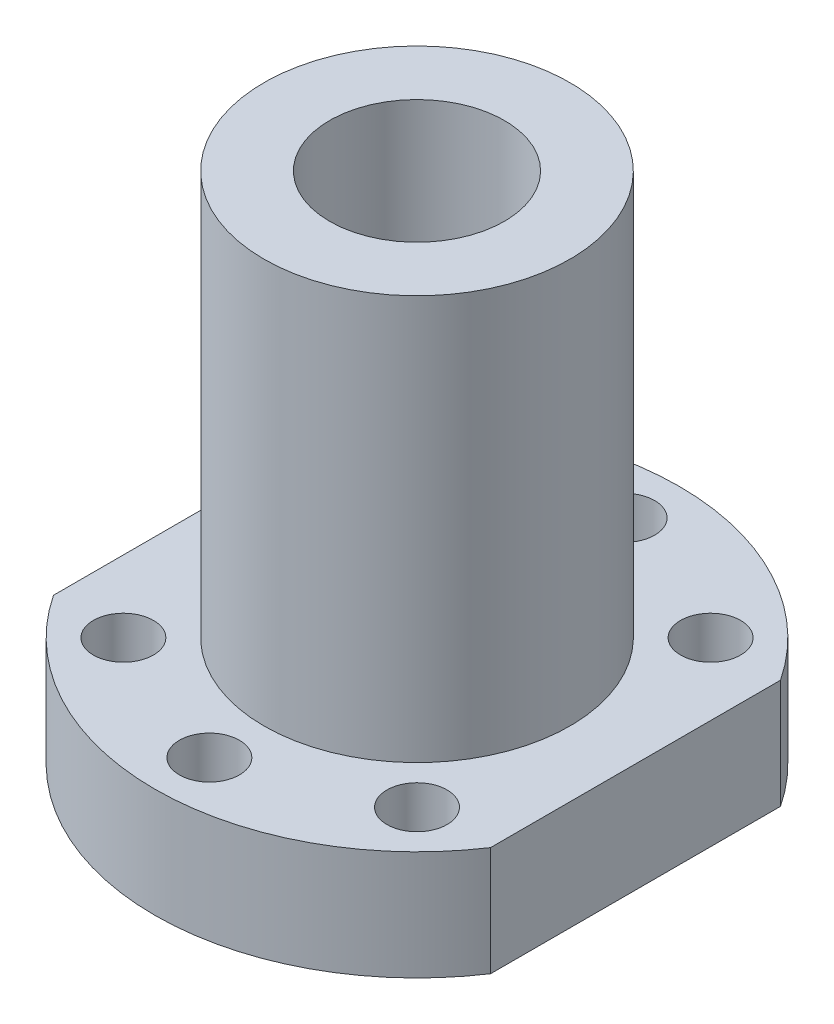
ISO-10303-21;
HEADER;
FILE_DESCRIPTION(('STEP AP214'),'2;1');
FILE_NAME('part.step','',(''),(''),'','','');
FILE_SCHEMA(('AUTOMOTIVE_DESIGN { 1 0 10303 214 1 1 1 1 }'));
ENDSEC;
DATA;
#1=APPLICATION_CONTEXT('core data for automotive mechanical design processes');
#2=APPLICATION_PROTOCOL_DEFINITION('international standard','automotive_design',2000,#1);
#3=PRODUCT_CONTEXT('',#1,'mechanical');
#4=PRODUCT('Part','Part','',(#3));
#5=PRODUCT_RELATED_PRODUCT_CATEGORY('part','',(#4));
#6=PRODUCT_DEFINITION_FORMATION('','',#4);
#7=PRODUCT_DEFINITION_CONTEXT('part definition',#1,'design');
#8=PRODUCT_DEFINITION('design','',#6,#7);
#9=PRODUCT_DEFINITION_SHAPE('','',#8);
#10=(LENGTH_UNIT() NAMED_UNIT(*) SI_UNIT(.MILLI.,.METRE.));
#11=(NAMED_UNIT(*) PLANE_ANGLE_UNIT() SI_UNIT($,.RADIAN.));
#12=(NAMED_UNIT(*) SI_UNIT($,.STERADIAN.) SOLID_ANGLE_UNIT());
#13=UNCERTAINTY_MEASURE_WITH_UNIT(LENGTH_MEASURE(1.E-05),#10,'distance_accuracy_value','');
#14=(GEOMETRIC_REPRESENTATION_CONTEXT(3) GLOBAL_UNCERTAINTY_ASSIGNED_CONTEXT((#13)) GLOBAL_UNIT_ASSIGNED_CONTEXT((#10,
#11,#12)) REPRESENTATION_CONTEXT('',''));
#15=CARTESIAN_POINT('',(0.,0.,0.));
#16=DIRECTION('',(0.,0.,1.));
#17=DIRECTION('',(1.,0.,0.));
#18=AXIS2_PLACEMENT_3D('',#15,#16,#17);
#19=CARTESIAN_POINT('',(20.,10.,0.));
#20=DIRECTION('',(1.,0.,0.));
#21=DIRECTION('',(0.,0.,-1.));
#22=AXIS2_PLACEMENT_3D('',#19,#20,#21);
#23=PLANE('',#22);
#24=DIRECTION('',(0.,0.,1.));
#25=VECTOR('',#24,1.);
#26=CARTESIAN_POINT('',(20.,0.,0.));
#27=LINE('',#26,#25);
#28=CARTESIAN_POINT('',(20.,0.,-13.2664991614216));
#29=VERTEX_POINT('',#28);
#30=CARTESIAN_POINT('',(20.,0.,13.2664991614216));
#31=VERTEX_POINT('',#30);
#32=EDGE_CURVE('E146',#29,#31,#27,.T.);
#33=ORIENTED_EDGE('',*,*,#32,.F.);
#34=DIRECTION('',(0.,-1.,0.));
#35=VECTOR('',#34,1.);
#36=CARTESIAN_POINT('',(20.,10.,-13.2664991614216));
#37=LINE('',#36,#35);
#38=CARTESIAN_POINT('',(20.,10.,-13.2664991614216));
#39=VERTEX_POINT('',#38);
#40=EDGE_CURVE('E11',#39,#29,#37,.T.);
#41=ORIENTED_EDGE('',*,*,#40,.F.);
#42=DIRECTION('',(0.,0.,1.));
#43=VECTOR('',#42,1.);
#44=CARTESIAN_POINT('',(20.,10.,0.));
#45=LINE('',#44,#43);
#46=CARTESIAN_POINT('',(20.,10.,13.2664991614216));
#47=VERTEX_POINT('',#46);
#48=EDGE_CURVE('E106',#39,#47,#45,.T.);
#49=ORIENTED_EDGE('',*,*,#48,.T.);
#50=DIRECTION('',(0.,-1.,0.));
#51=VECTOR('',#50,1.);
#52=CARTESIAN_POINT('',(20.,10.,13.2664991614216));
#53=LINE('',#52,#51);
#54=EDGE_CURVE('E86',#47,#31,#53,.T.);
#55=ORIENTED_EDGE('',*,*,#54,.T.);
#56=EDGE_LOOP('',(#33,#41,#49,#55));
#57=FACE_BOUND('',#56,.T.);
#58=ADVANCED_FACE('F40',(#57),#23,.T.);
#59=CARTESIAN_POINT('',(0.,10.,0.));
#60=DIRECTION('',(0.,-1.,0.));
#61=DIRECTION('',(0.,0.,-1.));
#62=AXIS2_PLACEMENT_3D('',#59,#60,#61);
#63=CYLINDRICAL_SURFACE('',#62,24.);
#64=CARTESIAN_POINT('',(0.,0.,0.));
#65=DIRECTION('',(0.,1.,0.));
#66=DIRECTION('',(0.,0.,1.));
#67=AXIS2_PLACEMENT_3D('',#64,#65,#66);
#68=CIRCLE('',#67,24.);
#69=CARTESIAN_POINT('',(-20.,0.,-13.2664991614216));
#70=VERTEX_POINT('',#69);
#71=EDGE_CURVE('E112',#29,#70,#68,.T.);
#72=ORIENTED_EDGE('',*,*,#71,.T.);
#73=DIRECTION('',(0.,-1.,0.));
#74=VECTOR('',#73,1.);
#75=CARTESIAN_POINT('',(-20.,10.,-13.2664991614216));
#76=LINE('',#75,#74);
#77=CARTESIAN_POINT('',(-20.,10.,-13.2664991614216));
#78=VERTEX_POINT('',#77);
#79=EDGE_CURVE('E56',#78,#70,#76,.T.);
#80=ORIENTED_EDGE('',*,*,#79,.F.);
#81=CARTESIAN_POINT('',(0.,10.,0.));
#82=DIRECTION('',(0.,1.,0.));
#83=DIRECTION('',(0.,0.,1.));
#84=AXIS2_PLACEMENT_3D('',#81,#82,#83);
#85=CIRCLE('',#84,24.);
#86=EDGE_CURVE('E102',#39,#78,#85,.T.);
#87=ORIENTED_EDGE('',*,*,#86,.F.);
#88=ORIENTED_EDGE('',*,*,#40,.T.);
#89=EDGE_LOOP('',(#72,#80,#87,#88));
#90=FACE_BOUND('',#89,.T.);
#91=ADVANCED_FACE('F110',(#90),#63,.T.);
#92=CARTESIAN_POINT('',(-20.,10.,0.));
#93=DIRECTION('',(1.,0.,0.));
#94=DIRECTION('',(0.,0.,-1.));
#95=AXIS2_PLACEMENT_3D('',#92,#93,#94);
#96=PLANE('',#95);
#97=CARTESIAN_POINT('',(-20.,5.,0.));
#98=DIRECTION('',(-1.,0.,0.));
#99=DIRECTION('',(0.,0.,1.));
#100=AXIS2_PLACEMENT_3D('',#97,#98,#99);
#101=CIRCLE('',#100,3.);
#102=CARTESIAN_POINT('',(-20.,5.,3.));
#103=VERTEX_POINT('',#102);
#104=EDGE_CURVE('E199',#103,#103,#101,.T.);
#105=ORIENTED_EDGE('',*,*,#104,.F.);
#106=EDGE_LOOP('',(#105));
#107=FACE_BOUND('',#106,.T.);
#108=DIRECTION('',(0.,0.,1.));
#109=VECTOR('',#108,1.);
#110=CARTESIAN_POINT('',(-20.,0.,0.));
#111=LINE('',#110,#109);
#112=CARTESIAN_POINT('',(-20.,0.,13.2664991614216));
#113=VERTEX_POINT('',#112);
#114=EDGE_CURVE('E141',#70,#113,#111,.T.);
#115=ORIENTED_EDGE('',*,*,#114,.T.);
#116=DIRECTION('',(0.,-1.,0.));
#117=VECTOR('',#116,1.);
#118=CARTESIAN_POINT('',(-20.,10.,13.2664991614216));
#119=LINE('',#118,#117);
#120=CARTESIAN_POINT('',(-20.,10.,13.2664991614216));
#121=VERTEX_POINT('',#120);
#122=EDGE_CURVE('E100',#121,#113,#119,.T.);
#123=ORIENTED_EDGE('',*,*,#122,.F.);
#124=DIRECTION('',(0.,0.,1.));
#125=VECTOR('',#124,1.);
#126=CARTESIAN_POINT('',(-20.,10.,0.));
#127=LINE('',#126,#125);
#128=EDGE_CURVE('E94',#78,#121,#127,.T.);
#129=ORIENTED_EDGE('',*,*,#128,.F.);
#130=ORIENTED_EDGE('',*,*,#79,.T.);
#131=EDGE_LOOP('',(#115,#123,#129,#130));
#132=FACE_BOUND('',#131,.T.);
#133=ADVANCED_FACE('F97',(#107,#132),#96,.F.);
#134=CARTESIAN_POINT('',(13.4350288425444,10.,13.4350288425444));
#135=DIRECTION('',(0.,-1.,0.));
#136=DIRECTION('',(0.,0.,-1.));
#137=AXIS2_PLACEMENT_3D('',#134,#135,#136);
#138=CYLINDRICAL_SURFACE('',#137,2.75);
#139=CARTESIAN_POINT('',(13.4350288425444,10.,13.4350288425444));
#140=DIRECTION('',(0.,1.,0.));
#141=DIRECTION('',(0.,0.,1.));
#142=AXIS2_PLACEMENT_3D('',#139,#140,#141);
#143=CIRCLE('',#142,2.75);
#144=CARTESIAN_POINT('',(13.4350288425444,10.,16.1850288425444));
#145=VERTEX_POINT('',#144);
#146=EDGE_CURVE('E161',#145,#145,#143,.F.);
#147=ORIENTED_EDGE('',*,*,#146,.F.);
#148=EDGE_LOOP('',(#147));
#149=FACE_BOUND('',#148,.T.);
#150=CARTESIAN_POINT('',(13.4350288425444,0.,13.4350288425444));
#151=DIRECTION('',(0.,1.,0.));
#152=DIRECTION('',(0.,0.,1.));
#153=AXIS2_PLACEMENT_3D('',#150,#151,#152);
#154=CIRCLE('',#153,2.75);
#155=CARTESIAN_POINT('',(13.4350288425444,0.,16.1850288425444));
#156=VERTEX_POINT('',#155);
#157=EDGE_CURVE('E127',#156,#156,#154,.F.);
#158=ORIENTED_EDGE('',*,*,#157,.T.);
#159=EDGE_LOOP('',(#158));
#160=FACE_BOUND('',#159,.T.);
#161=ADVANCED_FACE('F270',(#149,#160),#138,.F.);
#162=CARTESIAN_POINT('',(-13.4350288425444,10.,13.4350288425444));
#163=DIRECTION('',(0.,-1.,0.));
#164=DIRECTION('',(0.,0.,-1.));
#165=AXIS2_PLACEMENT_3D('',#162,#163,#164);
#166=CYLINDRICAL_SURFACE('',#165,2.75);
#167=CARTESIAN_POINT('',(-13.4350288425444,10.,13.4350288425444));
#168=DIRECTION('',(0.,1.,0.));
#169=DIRECTION('',(0.,0.,1.));
#170=AXIS2_PLACEMENT_3D('',#167,#168,#169);
#171=CIRCLE('',#170,2.75);
#172=CARTESIAN_POINT('',(-13.4350288425444,10.,16.1850288425444));
#173=VERTEX_POINT('',#172);
#174=EDGE_CURVE('E165',#173,#173,#171,.T.);
#175=ORIENTED_EDGE('',*,*,#174,.T.);
#176=EDGE_LOOP('',(#175));
#177=FACE_BOUND('',#176,.T.);
#178=CARTESIAN_POINT('',(-13.4350288425444,0.,13.4350288425444));
#179=DIRECTION('',(0.,1.,0.));
#180=DIRECTION('',(0.,0.,1.));
#181=AXIS2_PLACEMENT_3D('',#178,#179,#180);
#182=CIRCLE('',#181,2.75);
#183=CARTESIAN_POINT('',(-13.4350288425444,0.,16.1850288425444));
#184=VERTEX_POINT('',#183);
#185=EDGE_CURVE('E131',#184,#184,#182,.T.);
#186=ORIENTED_EDGE('',*,*,#185,.F.);
#187=EDGE_LOOP('',(#186));
#188=FACE_BOUND('',#187,.T.);
#189=ADVANCED_FACE('F273',(#177,#188),#166,.F.);
#190=CARTESIAN_POINT('',(0.,10.,19.));
#191=DIRECTION('',(0.,-1.,0.));
#192=DIRECTION('',(0.,0.,-1.));
#193=AXIS2_PLACEMENT_3D('',#190,#191,#192);
#194=CYLINDRICAL_SURFACE('',#193,2.75);
#195=CARTESIAN_POINT('',(0.,10.,19.));
#196=DIRECTION('',(0.,1.,0.));
#197=DIRECTION('',(0.,0.,1.));
#198=AXIS2_PLACEMENT_3D('',#195,#196,#197);
#199=CIRCLE('',#198,2.75);
#200=CARTESIAN_POINT('',(0.,10.,21.75));
#201=VERTEX_POINT('',#200);
#202=EDGE_CURVE('E169',#201,#201,#199,.T.);
#203=ORIENTED_EDGE('',*,*,#202,.T.);
#204=EDGE_LOOP('',(#203));
#205=FACE_BOUND('',#204,.T.);
#206=CARTESIAN_POINT('',(0.,0.,19.));
#207=DIRECTION('',(0.,1.,0.));
#208=DIRECTION('',(0.,0.,1.));
#209=AXIS2_PLACEMENT_3D('',#206,#207,#208);
#210=CIRCLE('',#209,2.75);
#211=CARTESIAN_POINT('',(0.,0.,21.75));
#212=VERTEX_POINT('',#211);
#213=EDGE_CURVE('E135',#212,#212,#210,.T.);
#214=ORIENTED_EDGE('',*,*,#213,.F.);
#215=EDGE_LOOP('',(#214));
#216=FACE_BOUND('',#215,.T.);
#217=ADVANCED_FACE('F249',(#205,#216),#194,.F.);
#218=CARTESIAN_POINT('',(0.,10.,0.));
#219=DIRECTION('',(0.,-1.,0.));
#220=DIRECTION('',(0.,0.,-1.));
#221=AXIS2_PLACEMENT_3D('',#218,#219,#220);
#222=CYLINDRICAL_SURFACE('',#221,24.);
#223=CARTESIAN_POINT('',(0.,0.,0.));
#224=DIRECTION('',(0.,1.,0.));
#225=DIRECTION('',(0.,0.,1.));
#226=AXIS2_PLACEMENT_3D('',#223,#224,#225);
#227=CIRCLE('',#226,24.);
#228=EDGE_CURVE('E79',#113,#31,#227,.T.);
#229=ORIENTED_EDGE('',*,*,#228,.T.);
#230=ORIENTED_EDGE('',*,*,#54,.F.);
#231=CARTESIAN_POINT('',(0.,10.,0.));
#232=DIRECTION('',(0.,1.,0.));
#233=DIRECTION('',(0.,0.,1.));
#234=AXIS2_PLACEMENT_3D('',#231,#232,#233);
#235=CIRCLE('',#234,24.);
#236=EDGE_CURVE('E64',#121,#47,#235,.T.);
#237=ORIENTED_EDGE('',*,*,#236,.F.);
#238=ORIENTED_EDGE('',*,*,#122,.T.);
#239=EDGE_LOOP('',(#229,#230,#237,#238));
#240=FACE_BOUND('',#239,.T.);
#241=ADVANCED_FACE('F242',(#240),#222,.T.);
#242=CARTESIAN_POINT('',(13.4350288425444,10.,-13.4350288425444));
#243=DIRECTION('',(0.,-1.,0.));
#244=DIRECTION('',(0.,0.,-1.));
#245=AXIS2_PLACEMENT_3D('',#242,#243,#244);
#246=CYLINDRICAL_SURFACE('',#245,2.75);
#247=CARTESIAN_POINT('',(13.4350288425444,10.,-13.4350288425444));
#248=DIRECTION('',(0.,1.,0.));
#249=DIRECTION('',(0.,0.,1.));
#250=AXIS2_PLACEMENT_3D('',#247,#248,#249);
#251=CIRCLE('',#250,2.75);
#252=CARTESIAN_POINT('',(13.4350288425444,10.,-10.6850288425444));
#253=VERTEX_POINT('',#252);
#254=EDGE_CURVE('E181',#253,#253,#251,.T.);
#255=ORIENTED_EDGE('',*,*,#254,.T.);
#256=EDGE_LOOP('',(#255));
#257=FACE_BOUND('',#256,.T.);
#258=CARTESIAN_POINT('',(13.4350288425444,0.,-13.4350288425444));
#259=DIRECTION('',(0.,1.,0.));
#260=DIRECTION('',(0.,0.,1.));
#261=AXIS2_PLACEMENT_3D('',#258,#259,#260);
#262=CIRCLE('',#261,2.75);
#263=CARTESIAN_POINT('',(13.4350288425444,0.,-10.6850288425444));
#264=VERTEX_POINT('',#263);
#265=EDGE_CURVE('E149',#264,#264,#262,.T.);
#266=ORIENTED_EDGE('',*,*,#265,.F.);
#267=EDGE_LOOP('',(#266));
#268=FACE_BOUND('',#267,.T.);
#269=ADVANCED_FACE('F240',(#257,#268),#246,.F.);
#270=CARTESIAN_POINT('',(0.,10.,-19.));
#271=DIRECTION('',(0.,-1.,0.));
#272=DIRECTION('',(0.,0.,-1.));
#273=AXIS2_PLACEMENT_3D('',#270,#271,#272);
#274=CYLINDRICAL_SURFACE('',#273,2.75);
#275=CARTESIAN_POINT('',(0.,10.,-19.));
#276=DIRECTION('',(0.,1.,0.));
#277=DIRECTION('',(0.,0.,1.));
#278=AXIS2_PLACEMENT_3D('',#275,#276,#277);
#279=CIRCLE('',#278,2.75);
#280=CARTESIAN_POINT('',(0.,10.,-16.25));
#281=VERTEX_POINT('',#280);
#282=EDGE_CURVE('E126',#281,#281,#279,.F.);
#283=ORIENTED_EDGE('',*,*,#282,.F.);
#284=EDGE_LOOP('',(#283));
#285=FACE_BOUND('',#284,.T.);
#286=CARTESIAN_POINT('',(0.,0.,-19.));
#287=DIRECTION('',(0.,1.,0.));
#288=DIRECTION('',(0.,0.,1.));
#289=AXIS2_PLACEMENT_3D('',#286,#287,#288);
#290=CIRCLE('',#289,2.75);
#291=CARTESIAN_POINT('',(0.,0.,-16.25));
#292=VERTEX_POINT('',#291);
#293=EDGE_CURVE('E153',#292,#292,#290,.F.);
#294=ORIENTED_EDGE('',*,*,#293,.T.);
#295=EDGE_LOOP('',(#294));
#296=FACE_BOUND('',#295,.T.);
#297=ADVANCED_FACE('F42',(#285,#296),#274,.F.);
#298=CARTESIAN_POINT('',(-13.4350288425444,10.,-13.4350288425444));
#299=DIRECTION('',(0.,-1.,0.));
#300=DIRECTION('',(0.,0.,-1.));
#301=AXIS2_PLACEMENT_3D('',#298,#299,#300);
#302=CYLINDRICAL_SURFACE('',#301,2.75);
#303=CARTESIAN_POINT('',(-13.4350288425444,10.,-13.4350288425444));
#304=DIRECTION('',(0.,1.,0.));
#305=DIRECTION('',(0.,0.,1.));
#306=AXIS2_PLACEMENT_3D('',#303,#304,#305);
#307=CIRCLE('',#306,2.75);
#308=CARTESIAN_POINT('',(-13.4350288425444,10.,-10.6850288425444));
#309=VERTEX_POINT('',#308);
#310=EDGE_CURVE('E121',#309,#309,#307,.F.);
#311=ORIENTED_EDGE('',*,*,#310,.F.);
#312=EDGE_LOOP('',(#311));
#313=FACE_BOUND('',#312,.T.);
#314=CARTESIAN_POINT('',(-13.4350288425444,0.,-13.4350288425444));
#315=DIRECTION('',(0.,1.,0.));
#316=DIRECTION('',(0.,0.,1.));
#317=AXIS2_PLACEMENT_3D('',#314,#315,#316);
#318=CIRCLE('',#317,2.75);
#319=CARTESIAN_POINT('',(-13.4350288425444,0.,-10.6850288425444));
#320=VERTEX_POINT('',#319);
#321=EDGE_CURVE('E122',#320,#320,#318,.F.);
#322=ORIENTED_EDGE('',*,*,#321,.T.);
#323=EDGE_LOOP('',(#322));
#324=FACE_BOUND('',#323,.T.);
#325=ADVANCED_FACE('F227',(#313,#324),#302,.F.);
#326=CARTESIAN_POINT('',(0.,10.,0.));
#327=DIRECTION('',(0.,1.,0.));
#328=DIRECTION('',(0.,0.,1.));
#329=AXIS2_PLACEMENT_3D('',#326,#327,#328);
#330=PLANE('',#329);
#331=ORIENTED_EDGE('',*,*,#282,.T.);
#332=EDGE_LOOP('',(#331));
#333=FACE_BOUND('',#332,.T.);
#334=ORIENTED_EDGE('',*,*,#254,.F.);
#335=EDGE_LOOP('',(#334));
#336=FACE_BOUND('',#335,.T.);
#337=ORIENTED_EDGE('',*,*,#48,.F.);
#338=ORIENTED_EDGE('',*,*,#86,.T.);
#339=ORIENTED_EDGE('',*,*,#128,.T.);
#340=ORIENTED_EDGE('',*,*,#236,.T.);
#341=EDGE_LOOP('',(#337,#338,#339,#340));
#342=FACE_BOUND('',#341,.T.);
#343=CARTESIAN_POINT('',(0.,10.,0.));
#344=DIRECTION('',(0.,1.,0.));
#345=DIRECTION('',(0.,0.,1.));
#346=AXIS2_PLACEMENT_3D('',#343,#344,#345);
#347=CIRCLE('',#346,14.);
#348=CARTESIAN_POINT('',(0.,10.,14.));
#349=VERTEX_POINT('',#348);
#350=EDGE_CURVE('E173',#349,#349,#347,.T.);
#351=ORIENTED_EDGE('',*,*,#350,.F.);
#352=EDGE_LOOP('',(#351));
#353=FACE_BOUND('',#352,.T.);
#354=ORIENTED_EDGE('',*,*,#202,.F.);
#355=EDGE_LOOP('',(#354));
#356=FACE_BOUND('',#355,.T.);
#357=ORIENTED_EDGE('',*,*,#174,.F.);
#358=EDGE_LOOP('',(#357));
#359=FACE_BOUND('',#358,.T.);
#360=ORIENTED_EDGE('',*,*,#146,.T.);
#361=EDGE_LOOP('',(#360));
#362=FACE_BOUND('',#361,.T.);
#363=ORIENTED_EDGE('',*,*,#310,.T.);
#364=EDGE_LOOP('',(#363));
#365=FACE_BOUND('',#364,.T.);
#366=ADVANCED_FACE('F104',(#333,#336,#342,#353,#356,#359,#362,#365),#330,.T.);
#367=CARTESIAN_POINT('',(0.,0.,0.));
#368=DIRECTION('',(0.,1.,0.));
#369=DIRECTION('',(0.,0.,1.));
#370=AXIS2_PLACEMENT_3D('',#367,#368,#369);
#371=PLANE('',#370);
#372=ORIENTED_EDGE('',*,*,#293,.F.);
#373=EDGE_LOOP('',(#372));
#374=FACE_BOUND('',#373,.T.);
#375=ORIENTED_EDGE('',*,*,#265,.T.);
#376=EDGE_LOOP('',(#375));
#377=FACE_BOUND('',#376,.T.);
#378=ORIENTED_EDGE('',*,*,#32,.T.);
#379=ORIENTED_EDGE('',*,*,#228,.F.);
#380=ORIENTED_EDGE('',*,*,#114,.F.);
#381=ORIENTED_EDGE('',*,*,#71,.F.);
#382=EDGE_LOOP('',(#378,#379,#380,#381));
#383=FACE_BOUND('',#382,.T.);
#384=ORIENTED_EDGE('',*,*,#213,.T.);
#385=EDGE_LOOP('',(#384));
#386=FACE_BOUND('',#385,.T.);
#387=ORIENTED_EDGE('',*,*,#185,.T.);
#388=EDGE_LOOP('',(#387));
#389=FACE_BOUND('',#388,.T.);
#390=ORIENTED_EDGE('',*,*,#157,.F.);
#391=EDGE_LOOP('',(#390));
#392=FACE_BOUND('',#391,.T.);
#393=ORIENTED_EDGE('',*,*,#321,.F.);
#394=EDGE_LOOP('',(#393));
#395=FACE_BOUND('',#394,.T.);
#396=CARTESIAN_POINT('',(0.,0.,0.));
#397=DIRECTION('',(0.,1.,0.));
#398=DIRECTION('',(0.,0.,1.));
#399=AXIS2_PLACEMENT_3D('',#396,#397,#398);
#400=CIRCLE('',#399,8.);
#401=CARTESIAN_POINT('',(0.,0.,8.));
#402=VERTEX_POINT('',#401);
#403=EDGE_CURVE('E188',#402,#402,#400,.T.);
#404=ORIENTED_EDGE('',*,*,#403,.T.);
#405=EDGE_LOOP('',(#404));
#406=FACE_BOUND('',#405,.T.);
#407=ADVANCED_FACE('F216',(#374,#377,#383,#386,#389,#392,#395,#406),#371,.F.);
#408=CARTESIAN_POINT('',(0.,47.,0.));
#409=DIRECTION('',(0.,-1.,0.));
#410=DIRECTION('',(0.,0.,-1.));
#411=AXIS2_PLACEMENT_3D('',#408,#409,#410);
#412=CYLINDRICAL_SURFACE('',#411,8.);
#413=CARTESIAN_POINT('',(-7.41619848709566,5.,3.));
#414=CARTESIAN_POINT('',(-7.41619281215226,4.8379850325166,3.00000608211288));
#415=CARTESIAN_POINT('',(-7.42156520296313,4.67601015487381,2.98683195095364));
#416=CARTESIAN_POINT('',(-7.44232318425766,4.35694383406478,2.93472375787483));
#417=CARTESIAN_POINT('',(-7.45770847484803,4.19985224478832,2.89579046745932));
#418=CARTESIAN_POINT('',(-7.49650960610891,3.89524925681117,2.79379315222297));
#419=CARTESIAN_POINT('',(-7.51990619151696,3.74771588670809,2.73078694533005));
#420=CARTESIAN_POINT('',(-7.57206268400018,3.46525620635206,2.58263713485087));
#421=CARTESIAN_POINT('',(-7.60082420131042,3.33033369943215,2.49748688189993));
#422=CARTESIAN_POINT('',(-7.66207149335192,3.0702193767573,2.30293322748412));
#423=CARTESIAN_POINT('',(-7.69466683848217,2.945742940742,2.19260762426636));
#424=CARTESIAN_POINT('',(-7.75899501256083,2.71655437065623,1.95279167955762));
#425=CARTESIAN_POINT('',(-7.79072765629295,2.61184645251608,1.8232972605133));
#426=CARTESIAN_POINT('',(-7.8510574787339,2.421720975409,1.54338931035527));
#427=CARTESIAN_POINT('',(-7.87951122447087,2.33708105056834,1.39241389507607));
#428=CARTESIAN_POINT('',(-7.92876015947619,2.19469765495012,1.07711154393048));
#429=CARTESIAN_POINT('',(-7.94955800433994,2.13694485601604,0.912789261867066));
#430=CARTESIAN_POINT('',(-7.98037394206897,2.05248420845078,0.582978683353669));
#431=CARTESIAN_POINT('',(-7.99081830429549,2.02454474511909,0.417846394563197));
#432=CARTESIAN_POINT('',(-8.0012802821588,1.99655759811003,0.0849287275895673));
#433=CARTESIAN_POINT('',(-8.0013012882982,1.9965008447626,-0.0828557701256795));
#434=CARTESIAN_POINT('',(-7.99118531807773,2.02356352293033,-0.407487086128939));
#435=CARTESIAN_POINT('',(-7.98155083993306,2.04933859589756,-0.564464356533754));
#436=CARTESIAN_POINT('',(-7.95386549864585,2.12507183045118,-0.871678435968827));
#437=CARTESIAN_POINT('',(-7.93581403951378,2.17503170452435,-1.02191476686076));
#438=CARTESIAN_POINT('',(-7.89275538334835,2.29834090335142,-1.31397803460604));
#439=CARTESIAN_POINT('',(-7.86765078939303,2.37202001053579,-1.45565078457397));
#440=CARTESIAN_POINT('',(-7.81302620451409,2.5403841938598,-1.72497321591576));
#441=CARTESIAN_POINT('',(-7.78350479028858,2.63507604603904,-1.85261835386705));
#442=CARTESIAN_POINT('',(-7.72105059308269,2.84925457256232,-2.09818097359933));
#443=CARTESIAN_POINT('',(-7.68801927514871,2.96986783128531,-2.2150922905172));
#444=CARTESIAN_POINT('',(-7.62364921304341,3.22918598665867,-2.42740791139661));
#445=CARTESIAN_POINT('',(-7.59231089545926,3.36789541323143,-2.52280681389449));
#446=CARTESIAN_POINT('',(-7.53425406951149,3.66343893487736,-2.69131223613208));
#447=CARTESIAN_POINT('',(-7.50765354114235,3.82060698717146,-2.76387695690677));
#448=CARTESIAN_POINT('',(-7.4634487707231,4.14619245012777,-2.88112928869848));
#449=CARTESIAN_POINT('',(-7.44583952363152,4.31460354312571,-2.925832412077));
#450=CARTESIAN_POINT('',(-7.42279194491541,4.64795192467548,-2.98380383422378));
#451=CARTESIAN_POINT('',(-7.41673570495336,4.81256821108394,-2.99867042318746));
#452=CARTESIAN_POINT('',(-7.41573079037772,5.14201871347183,-3.00115771271731));
#453=CARTESIAN_POINT('',(-7.42077934004762,5.30685286470189,-2.9887852218731));
#454=CARTESIAN_POINT('',(-7.44078763262529,5.62385984457827,-2.93859467040517));
#455=CARTESIAN_POINT('',(-7.45526552433718,5.7762622715301,-2.90201236668503));
#456=CARTESIAN_POINT('',(-7.49192974091902,6.07269588943961,-2.80599549281221));
#457=CARTESIAN_POINT('',(-7.51411764500121,6.21672535833606,-2.74655624069231));
#458=CARTESIAN_POINT('',(-7.56472486232391,6.49832887615263,-2.60400584550571));
#459=CARTESIAN_POINT('',(-7.59334657784192,6.63545858427474,-2.52009090354098));
#460=CARTESIAN_POINT('',(-7.6532562858852,6.89425796345202,-2.33182635724954));
#461=CARTESIAN_POINT('',(-7.68454525188137,7.01592194924925,-2.22746927392868));
#462=CARTESIAN_POINT('',(-7.74866093106386,7.24833674639021,-1.99345468180189));
#463=CARTESIAN_POINT('',(-7.7814593871406,7.35790681753751,-1.86261268298213));
#464=CARTESIAN_POINT('',(-7.84299749926599,7.55367673517887,-1.5835949435063));
#465=CARTESIAN_POINT('',(-7.87173714215327,7.63987650589168,-1.43541914664535));
#466=CARTESIAN_POINT('',(-7.92189971409105,7.78589211239923,-1.12603265893695));
#467=CARTESIAN_POINT('',(-7.9433476267602,7.84579824758521,-0.964868866129254));
#468=CARTESIAN_POINT('',(-7.97658873425142,7.93731282769984,-0.633763775046511));
#469=CARTESIAN_POINT('',(-7.98838646598825,7.9689345708448,-0.463826641447187));
#470=CARTESIAN_POINT('',(-8.00056814634147,8.00154880550965,-0.130671170547633));
#471=CARTESIAN_POINT('',(-8.00157721907528,8.00421896611798,0.032361536121689));
#472=CARTESIAN_POINT('',(-7.99369779618447,7.98316968110921,0.356453572824846));
#473=CARTESIAN_POINT('',(-7.98481049426262,7.95945341822829,0.517513138490513));
#474=CARTESIAN_POINT('',(-7.95842179207541,7.88748229701276,0.82909649675425));
#475=CARTESIAN_POINT('',(-7.9411358275603,7.83984018824329,0.979781462137666));
#476=CARTESIAN_POINT('',(-7.89975567241984,7.72197997323128,1.27103094601278));
#477=CARTESIAN_POINT('',(-7.87566019311345,7.6517575933905,1.41159354255109));
#478=CARTESIAN_POINT('',(-7.8218123660013,7.48737211299037,1.68508035398882));
#479=CARTESIAN_POINT('',(-7.79186480217587,7.39232671897168,1.81743509769368));
#480=CARTESIAN_POINT('',(-7.72999015389759,7.18238433962482,2.06483469504673));
#481=CARTESIAN_POINT('',(-7.69806236548317,7.06748026838437,2.17987334251184));
#482=CARTESIAN_POINT('',(-7.63376259478074,6.81387173670976,2.39562428472386));
#483=CARTESIAN_POINT('',(-7.60145610697262,6.67423119569092,2.49525999632031));
#484=CARTESIAN_POINT('',(-7.54196650008334,6.37916826085381,2.66969419113705));
#485=CARTESIAN_POINT('',(-7.51478391266386,6.22374423189476,2.74449009756384));
#486=CARTESIAN_POINT('',(-7.46804539702406,5.89408863804739,2.86931773948447));
#487=CARTESIAN_POINT('',(-7.44887606566003,5.71933126696959,2.91812005798766));
#488=CARTESIAN_POINT('',(-7.42295988688337,5.36302945609527,2.98344713444437));
#489=CARTESIAN_POINT('',(-7.41620484418155,5.18148957460557,2.99999318680184));
#490=CARTESIAN_POINT('',(-7.41619848709566,5.,3.));
#491=B_SPLINE_CURVE_WITH_KNOTS('',3,(#413,#414,#415,#416,#417,#418,#419,#420,#421,#422,#423,
#424,#425,#426,#427,#428,#429,#430,#431,#432,#433,#434,#435,#436,#437,#438,#439,#440,#441,#442,
#443,#444,#445,#446,#447,#448,#449,#450,#451,#452,#453,#454,#455,#456,#457,#458,#459,#460,#461,
#462,#463,#464,#465,#466,#467,#468,#469,#470,#471,#472,#473,#474,#475,#476,#477,#478,#479,#480,
#481,#482,#483,#484,#485,#486,#487,#488,#489,#490),.UNSPECIFIED.,.T.,.F.,(4,2,2,2,2,2,2,2,2,2,2,
2,2,2,2,2,2,2,2,2,2,2,2,2,2,2,2,2,2,2,2,2,2,2,2,2,2,2,4),(0.,0.485369082889299,
0.970723629307669,1.45491971362402,1.93926135947583,2.44549304813252,2.95183257656962,
3.47540144283838,3.99878852773656,4.49960036990354,5.0002493082071,5.47612945617384,
5.95204330537666,6.43488262432332,6.91787787268947,7.42913350142745,7.94051735665665,
8.46325184520832,8.98569503290588,9.47931315500611,9.97280790797409,10.4428769187604,
10.9130422687869,11.4008312203128,11.8887989695235,12.4077003400689,12.9266033932,
13.4437101779998,13.9605737113989,14.4473144111951,14.933996406586,15.4088054802742,
15.883704470453,16.3785664737361,16.8736054180957,17.394771991038,17.9159926110812,
18.4600635776149,19.0037752466575),.UNSPECIFIED.);
#492=CARTESIAN_POINT('',(-7.41619848709566,5.,3.));
#493=VERTEX_POINT('',#492);
#494=EDGE_CURVE('E44',#493,#493,#491,.T.);
#495=ORIENTED_EDGE('',*,*,#494,.F.);
#496=EDGE_LOOP('',(#495));
#497=FACE_BOUND('',#496,.T.);
#498=CARTESIAN_POINT('',(0.,47.,0.));
#499=DIRECTION('',(0.,1.,0.));
#500=DIRECTION('',(0.,0.,1.));
#501=AXIS2_PLACEMENT_3D('',#498,#499,#500);
#502=CIRCLE('',#501,8.);
#503=CARTESIAN_POINT('',(0.,47.,8.));
#504=VERTEX_POINT('',#503);
#505=EDGE_CURVE('E192',#504,#504,#502,.T.);
#506=ORIENTED_EDGE('',*,*,#505,.T.);
#507=EDGE_LOOP('',(#506));
#508=FACE_BOUND('',#507,.T.);
#509=ORIENTED_EDGE('',*,*,#403,.F.);
#510=EDGE_LOOP('',(#509));
#511=FACE_BOUND('',#510,.T.);
#512=ADVANCED_FACE('F212',(#497,#508,#511),#412,.F.);
#513=CARTESIAN_POINT('',(0.,47.,0.));
#514=DIRECTION('',(0.,-1.,0.));
#515=DIRECTION('',(0.,0.,-1.));
#516=AXIS2_PLACEMENT_3D('',#513,#514,#515);
#517=CYLINDRICAL_SURFACE('',#516,14.);
#518=ORIENTED_EDGE('',*,*,#350,.T.);
#519=EDGE_LOOP('',(#518));
#520=FACE_BOUND('',#519,.T.);
#521=CARTESIAN_POINT('',(0.,47.,0.));
#522=DIRECTION('',(0.,1.,0.));
#523=DIRECTION('',(0.,0.,1.));
#524=AXIS2_PLACEMENT_3D('',#521,#522,#523);
#525=CIRCLE('',#524,14.);
#526=CARTESIAN_POINT('',(0.,47.,14.));
#527=VERTEX_POINT('',#526);
#528=EDGE_CURVE('E157',#527,#527,#525,.T.);
#529=ORIENTED_EDGE('',*,*,#528,.F.);
#530=EDGE_LOOP('',(#529));
#531=FACE_BOUND('',#530,.T.);
#532=ADVANCED_FACE('F215',(#520,#531),#517,.T.);
#533=CARTESIAN_POINT('',(0.,47.,0.));
#534=DIRECTION('',(0.,1.,0.));
#535=DIRECTION('',(0.,0.,1.));
#536=AXIS2_PLACEMENT_3D('',#533,#534,#535);
#537=PLANE('',#536);
#538=ORIENTED_EDGE('',*,*,#505,.F.);
#539=EDGE_LOOP('',(#538));
#540=FACE_BOUND('',#539,.T.);
#541=ORIENTED_EDGE('',*,*,#528,.T.);
#542=EDGE_LOOP('',(#541));
#543=FACE_BOUND('',#542,.T.);
#544=ADVANCED_FACE('F342',(#540,#543),#537,.T.);
#545=CARTESIAN_POINT('',(0.,5.,0.));
#546=DIRECTION('',(-1.,0.,0.));
#547=DIRECTION('',(0.,0.,1.));
#548=AXIS2_PLACEMENT_3D('',#545,#546,#547);
#549=CYLINDRICAL_SURFACE('',#548,3.);
#550=ORIENTED_EDGE('',*,*,#494,.T.);
#551=EDGE_LOOP('',(#550));
#552=FACE_BOUND('',#551,.T.);
#553=ORIENTED_EDGE('',*,*,#104,.T.);
#554=EDGE_LOOP('',(#553));
#555=FACE_BOUND('',#554,.T.);
#556=ADVANCED_FACE('F210',(#552,#555),#549,.F.);
#557=CLOSED_SHELL('',(#58,#91,#133,#161,#189,#217,#241,#269,#297,#325,#366,#407,#512,#532,#544,#556));
#558=MANIFOLD_SOLID_BREP('B2',#557);
#559=ADVANCED_BREP_SHAPE_REPRESENTATION('',(#18,#558),#14);
#560=SHAPE_DEFINITION_REPRESENTATION(#9,#559);
ENDSEC;
END-ISO-10303-21;
